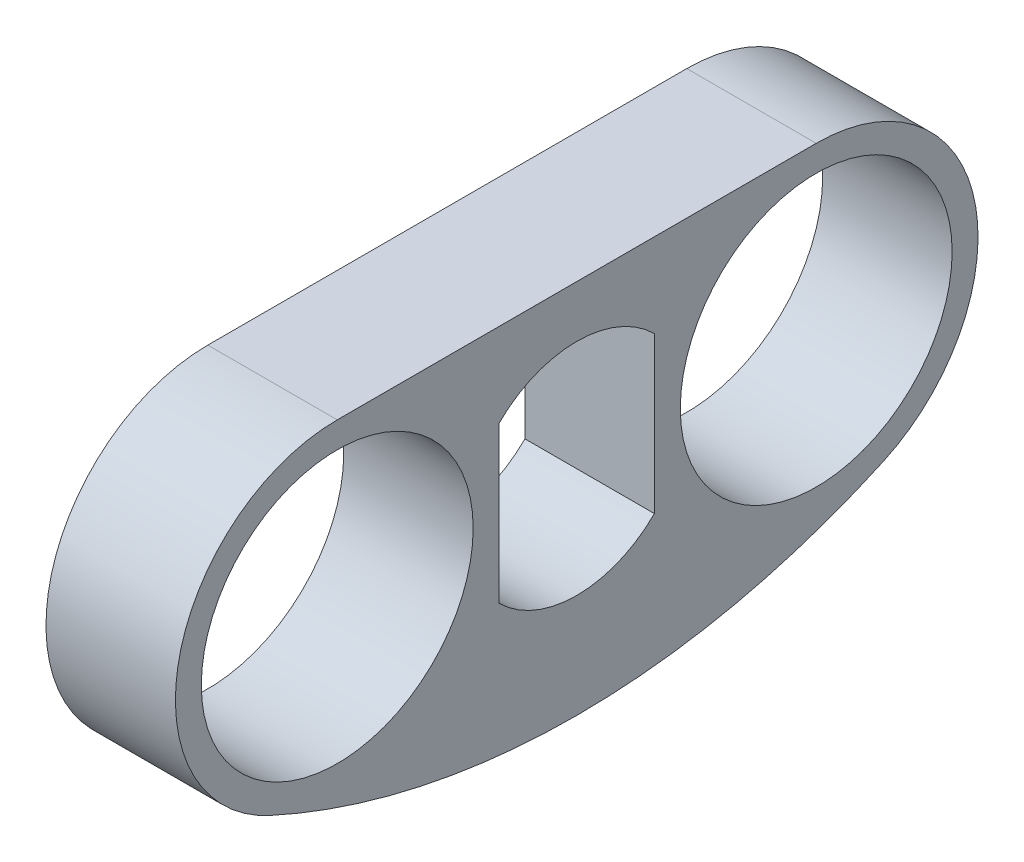
ISO-10303-21;
HEADER;
FILE_DESCRIPTION(('STEP AP214'),'2;1');
FILE_NAME('part.step','',(''),(''),'','','');
FILE_SCHEMA(('AUTOMOTIVE_DESIGN { 1 0 10303 214 1 1 1 1 }'));
ENDSEC;
DATA;
#1=APPLICATION_CONTEXT('core data for automotive mechanical design processes');
#2=APPLICATION_PROTOCOL_DEFINITION('international standard','automotive_design',2000,#1);
#3=PRODUCT_CONTEXT('',#1,'mechanical');
#4=PRODUCT('Part','Part','',(#3));
#5=PRODUCT_RELATED_PRODUCT_CATEGORY('part','',(#4));
#6=PRODUCT_DEFINITION_FORMATION('','',#4);
#7=PRODUCT_DEFINITION_CONTEXT('part definition',#1,'design');
#8=PRODUCT_DEFINITION('design','',#6,#7);
#9=PRODUCT_DEFINITION_SHAPE('','',#8);
#10=(LENGTH_UNIT() NAMED_UNIT(*) SI_UNIT(.MILLI.,.METRE.));
#11=(NAMED_UNIT(*) PLANE_ANGLE_UNIT() SI_UNIT($,.RADIAN.));
#12=(NAMED_UNIT(*) SI_UNIT($,.STERADIAN.) SOLID_ANGLE_UNIT());
#13=UNCERTAINTY_MEASURE_WITH_UNIT(LENGTH_MEASURE(1.E-05),#10,'distance_accuracy_value','');
#14=(GEOMETRIC_REPRESENTATION_CONTEXT(3) GLOBAL_UNCERTAINTY_ASSIGNED_CONTEXT((#13)) GLOBAL_UNIT_ASSIGNED_CONTEXT((#10,
#11,#12)) REPRESENTATION_CONTEXT('',''));
#15=CARTESIAN_POINT('',(0.,0.,0.));
#16=DIRECTION('',(0.,0.,1.));
#17=DIRECTION('',(1.,0.,0.));
#18=AXIS2_PLACEMENT_3D('',#15,#16,#17);
#19=CARTESIAN_POINT('',(10.,0.,18.5));
#20=DIRECTION('',(1.,0.,0.));
#21=DIRECTION('',(0.,0.,-1.));
#22=AXIS2_PLACEMENT_3D('',#19,#20,#21);
#23=PLANE('',#22);
#24=CARTESIAN_POINT('',(10.,0.,-18.5));
#25=DIRECTION('',(1.,0.,0.));
#26=DIRECTION('',(0.,0.,-1.));
#27=AXIS2_PLACEMENT_3D('',#24,#25,#26);
#28=CIRCLE('',#27,10.5);
#29=CARTESIAN_POINT('',(10.,0.,-29.));
#30=VERTEX_POINT('',#29);
#31=EDGE_CURVE('E146',#30,#30,#28,.T.);
#32=ORIENTED_EDGE('',*,*,#31,.F.);
#33=EDGE_LOOP('',(#32));
#34=FACE_BOUND('',#33,.T.);
#35=CARTESIAN_POINT('',(10.,0.,18.5));
#36=DIRECTION('',(1.,0.,0.));
#37=DIRECTION('',(0.,0.,-1.));
#38=AXIS2_PLACEMENT_3D('',#35,#36,#37);
#39=CIRCLE('',#38,12.5);
#40=CARTESIAN_POINT('',(10.,12.5,18.5));
#41=VERTEX_POINT('',#40);
#42=CARTESIAN_POINT('',(10.,-11.3685990701393,23.6966292134832));
#43=VERTEX_POINT('',#42);
#44=EDGE_CURVE('E162',#41,#43,#39,.T.);
#45=ORIENTED_EDGE('',*,*,#44,.T.);
#46=CARTESIAN_POINT('',(10.,40.4722126896961,0.));
#47=DIRECTION('',(1.,0.,0.));
#48=DIRECTION('',(0.,0.,-1.));
#49=AXIS2_PLACEMENT_3D('',#46,#47,#48);
#50=CIRCLE('',#49,57.);
#51=CARTESIAN_POINT('',(10.,-11.3685990701394,-23.6966292134831));
#52=VERTEX_POINT('',#51);
#53=EDGE_CURVE('E166',#43,#52,#50,.T.);
#54=ORIENTED_EDGE('',*,*,#53,.T.);
#55=CARTESIAN_POINT('',(10.,0.,-18.5));
#56=DIRECTION('',(1.,0.,0.));
#57=DIRECTION('',(0.,0.,-1.));
#58=AXIS2_PLACEMENT_3D('',#55,#56,#57);
#59=CIRCLE('',#58,12.5);
#60=CARTESIAN_POINT('',(10.,12.5,-18.5));
#61=VERTEX_POINT('',#60);
#62=EDGE_CURVE('E170',#52,#61,#59,.T.);
#63=ORIENTED_EDGE('',*,*,#62,.T.);
#64=DIRECTION('',(0.,0.,1.));
#65=VECTOR('',#64,1.);
#66=CARTESIAN_POINT('',(10.,12.5,18.5));
#67=LINE('',#66,#65);
#68=EDGE_CURVE('E173',#61,#41,#67,.T.);
#69=ORIENTED_EDGE('',*,*,#68,.T.);
#70=EDGE_LOOP('',(#45,#54,#63,#69));
#71=FACE_BOUND('',#70,.T.);
#72=DIRECTION('',(0.,-1.,0.));
#73=VECTOR('',#72,1.);
#74=CARTESIAN_POINT('',(10.,-6.02079728939615,6.));
#75=LINE('',#74,#73);
#76=CARTESIAN_POINT('',(10.,6.02079728939615,6.));
#77=VERTEX_POINT('',#76);
#78=CARTESIAN_POINT('',(10.,-6.02079728939615,6.));
#79=VERTEX_POINT('',#78);
#80=EDGE_CURVE('E120',#77,#79,#75,.T.);
#81=ORIENTED_EDGE('',*,*,#80,.F.);
#82=CARTESIAN_POINT('',(10.,0.,0.));
#83=DIRECTION('',(1.,0.,0.));
#84=DIRECTION('',(0.,0.,-1.));
#85=AXIS2_PLACEMENT_3D('',#82,#83,#84);
#86=CIRCLE('',#85,8.5);
#87=CARTESIAN_POINT('',(10.,6.02079728939615,-6.));
#88=VERTEX_POINT('',#87);
#89=EDGE_CURVE('E111',#88,#77,#86,.T.);
#90=ORIENTED_EDGE('',*,*,#89,.F.);
#91=DIRECTION('',(0.,1.,0.));
#92=VECTOR('',#91,1.);
#93=CARTESIAN_POINT('',(10.,-6.02079728939615,-6.));
#94=LINE('',#93,#92);
#95=CARTESIAN_POINT('',(10.,-6.02079728939615,-6.));
#96=VERTEX_POINT('',#95);
#97=EDGE_CURVE('E138',#96,#88,#94,.T.);
#98=ORIENTED_EDGE('',*,*,#97,.F.);
#99=CARTESIAN_POINT('',(10.,0.,0.));
#100=DIRECTION('',(1.,0.,0.));
#101=DIRECTION('',(0.,0.,-1.));
#102=AXIS2_PLACEMENT_3D('',#99,#100,#101);
#103=CIRCLE('',#102,8.5);
#104=EDGE_CURVE('E134',#79,#96,#103,.T.);
#105=ORIENTED_EDGE('',*,*,#104,.F.);
#106=EDGE_LOOP('',(#81,#90,#98,#105));
#107=FACE_BOUND('',#106,.T.);
#108=CARTESIAN_POINT('',(10.,0.,18.5));
#109=DIRECTION('',(1.,0.,0.));
#110=DIRECTION('',(0.,0.,1.));
#111=AXIS2_PLACEMENT_3D('',#108,#109,#110);
#112=CIRCLE('',#111,10.5);
#113=CARTESIAN_POINT('',(10.,0.,29.));
#114=VERTEX_POINT('',#113);
#115=EDGE_CURVE('E263',#114,#114,#112,.T.);
#116=ORIENTED_EDGE('',*,*,#115,.F.);
#117=EDGE_LOOP('',(#116));
#118=FACE_BOUND('',#117,.T.);
#119=ADVANCED_FACE('F45',(#34,#71,#107,#118),#23,.T.);
#120=CARTESIAN_POINT('',(0.,0.,18.5));
#121=DIRECTION('',(1.,0.,0.));
#122=DIRECTION('',(0.,0.,-1.));
#123=AXIS2_PLACEMENT_3D('',#120,#121,#122);
#124=PLANE('',#123);
#125=CARTESIAN_POINT('',(0.,0.,18.5));
#126=DIRECTION('',(1.,0.,0.));
#127=DIRECTION('',(0.,0.,-1.));
#128=AXIS2_PLACEMENT_3D('',#125,#126,#127);
#129=CIRCLE('',#128,12.5);
#130=CARTESIAN_POINT('',(0.,12.5,18.5));
#131=VERTEX_POINT('',#130);
#132=CARTESIAN_POINT('',(0.,-11.3685990701393,23.6966292134832));
#133=VERTEX_POINT('',#132);
#134=EDGE_CURVE('E129',#131,#133,#129,.T.);
#135=ORIENTED_EDGE('',*,*,#134,.F.);
#136=DIRECTION('',(0.,0.,1.));
#137=VECTOR('',#136,1.);
#138=CARTESIAN_POINT('',(0.,12.5,18.5));
#139=LINE('',#138,#137);
#140=CARTESIAN_POINT('',(0.,12.5,-18.5));
#141=VERTEX_POINT('',#140);
#142=EDGE_CURVE('E167',#141,#131,#139,.T.);
#143=ORIENTED_EDGE('',*,*,#142,.F.);
#144=CARTESIAN_POINT('',(0.,0.,-18.5));
#145=DIRECTION('',(1.,0.,0.));
#146=DIRECTION('',(0.,0.,-1.));
#147=AXIS2_PLACEMENT_3D('',#144,#145,#146);
#148=CIRCLE('',#147,12.5);
#149=CARTESIAN_POINT('',(0.,-11.3685990701394,-23.6966292134831));
#150=VERTEX_POINT('',#149);
#151=EDGE_CURVE('E183',#150,#141,#148,.T.);
#152=ORIENTED_EDGE('',*,*,#151,.F.);
#153=CARTESIAN_POINT('',(0.,40.4722126896961,0.));
#154=DIRECTION('',(1.,0.,0.));
#155=DIRECTION('',(0.,0.,-1.));
#156=AXIS2_PLACEMENT_3D('',#153,#154,#155);
#157=CIRCLE('',#156,57.);
#158=EDGE_CURVE('E180',#133,#150,#157,.T.);
#159=ORIENTED_EDGE('',*,*,#158,.F.);
#160=EDGE_LOOP('',(#135,#143,#152,#159));
#161=FACE_BOUND('',#160,.T.);
#162=CARTESIAN_POINT('',(0.,0.,0.));
#163=DIRECTION('',(1.,0.,0.));
#164=DIRECTION('',(0.,0.,-1.));
#165=AXIS2_PLACEMENT_3D('',#162,#163,#164);
#166=CIRCLE('',#165,8.5);
#167=CARTESIAN_POINT('',(0.,6.02079728939615,-6.));
#168=VERTEX_POINT('',#167);
#169=CARTESIAN_POINT('',(0.,6.02079728939615,6.));
#170=VERTEX_POINT('',#169);
#171=EDGE_CURVE('E69',#168,#170,#166,.T.);
#172=ORIENTED_EDGE('',*,*,#171,.T.);
#173=DIRECTION('',(0.,-1.,0.));
#174=VECTOR('',#173,1.);
#175=CARTESIAN_POINT('',(0.,-6.02079728939615,6.));
#176=LINE('',#175,#174);
#177=CARTESIAN_POINT('',(0.,-6.02079728939615,6.));
#178=VERTEX_POINT('',#177);
#179=EDGE_CURVE('E127',#170,#178,#176,.T.);
#180=ORIENTED_EDGE('',*,*,#179,.T.);
#181=CARTESIAN_POINT('',(0.,0.,0.));
#182=DIRECTION('',(1.,0.,0.));
#183=DIRECTION('',(0.,0.,-1.));
#184=AXIS2_PLACEMENT_3D('',#181,#182,#183);
#185=CIRCLE('',#184,8.5);
#186=CARTESIAN_POINT('',(0.,-6.02079728939615,-6.));
#187=VERTEX_POINT('',#186);
#188=EDGE_CURVE('E149',#178,#187,#185,.T.);
#189=ORIENTED_EDGE('',*,*,#188,.T.);
#190=DIRECTION('',(0.,1.,0.));
#191=VECTOR('',#190,1.);
#192=CARTESIAN_POINT('',(0.,-6.02079728939615,-6.));
#193=LINE('',#192,#191);
#194=EDGE_CURVE('E121',#187,#168,#193,.T.);
#195=ORIENTED_EDGE('',*,*,#194,.T.);
#196=EDGE_LOOP('',(#172,#180,#189,#195));
#197=FACE_BOUND('',#196,.T.);
#198=CARTESIAN_POINT('',(0.,0.,-18.5));
#199=DIRECTION('',(1.,0.,0.));
#200=DIRECTION('',(0.,0.,-1.));
#201=AXIS2_PLACEMENT_3D('',#198,#199,#200);
#202=CIRCLE('',#201,10.5);
#203=CARTESIAN_POINT('',(0.,0.,-29.));
#204=VERTEX_POINT('',#203);
#205=EDGE_CURVE('E271',#204,#204,#202,.T.);
#206=ORIENTED_EDGE('',*,*,#205,.T.);
#207=EDGE_LOOP('',(#206));
#208=FACE_BOUND('',#207,.T.);
#209=CARTESIAN_POINT('',(0.,0.,18.5));
#210=DIRECTION('',(1.,0.,0.));
#211=DIRECTION('',(0.,0.,1.));
#212=AXIS2_PLACEMENT_3D('',#209,#210,#211);
#213=CIRCLE('',#212,10.5);
#214=CARTESIAN_POINT('',(0.,0.,29.));
#215=VERTEX_POINT('',#214);
#216=EDGE_CURVE('E266',#215,#215,#213,.T.);
#217=ORIENTED_EDGE('',*,*,#216,.T.);
#218=EDGE_LOOP('',(#217));
#219=FACE_BOUND('',#218,.T.);
#220=ADVANCED_FACE('F206',(#161,#197,#208,#219),#124,.F.);
#221=CARTESIAN_POINT('',(10.,0.,18.5));
#222=DIRECTION('',(-1.,0.,0.));
#223=DIRECTION('',(0.,0.,1.));
#224=AXIS2_PLACEMENT_3D('',#221,#222,#223);
#225=CYLINDRICAL_SURFACE('',#224,12.5);
#226=ORIENTED_EDGE('',*,*,#134,.T.);
#227=DIRECTION('',(-1.,0.,0.));
#228=VECTOR('',#227,1.);
#229=CARTESIAN_POINT('',(10.,-11.3685990701393,23.6966292134832));
#230=LINE('',#229,#228);
#231=EDGE_CURVE('E11',#43,#133,#230,.T.);
#232=ORIENTED_EDGE('',*,*,#231,.F.);
#233=ORIENTED_EDGE('',*,*,#44,.F.);
#234=DIRECTION('',(-1.,0.,0.));
#235=VECTOR('',#234,1.);
#236=CARTESIAN_POINT('',(10.,12.5,18.5));
#237=LINE('',#236,#235);
#238=EDGE_CURVE('E176',#41,#131,#237,.T.);
#239=ORIENTED_EDGE('',*,*,#238,.T.);
#240=EDGE_LOOP('',(#226,#232,#233,#239));
#241=FACE_BOUND('',#240,.T.);
#242=ADVANCED_FACE('F47',(#241),#225,.T.);
#243=CARTESIAN_POINT('',(10.,40.4722126896961,0.));
#244=DIRECTION('',(-1.,0.,0.));
#245=DIRECTION('',(0.,0.,1.));
#246=AXIS2_PLACEMENT_3D('',#243,#244,#245);
#247=CYLINDRICAL_SURFACE('',#246,57.);
#248=ORIENTED_EDGE('',*,*,#158,.T.);
#249=DIRECTION('',(-1.,0.,0.));
#250=VECTOR('',#249,1.);
#251=CARTESIAN_POINT('',(10.,-11.3685990701394,-23.6966292134831));
#252=LINE('',#251,#250);
#253=EDGE_CURVE('E54',#52,#150,#252,.T.);
#254=ORIENTED_EDGE('',*,*,#253,.F.);
#255=ORIENTED_EDGE('',*,*,#53,.F.);
#256=ORIENTED_EDGE('',*,*,#231,.T.);
#257=EDGE_LOOP('',(#248,#254,#255,#256));
#258=FACE_BOUND('',#257,.T.);
#259=ADVANCED_FACE('F216',(#258),#247,.T.);
#260=CARTESIAN_POINT('',(10.,0.,-18.5));
#261=DIRECTION('',(-1.,0.,0.));
#262=DIRECTION('',(0.,0.,1.));
#263=AXIS2_PLACEMENT_3D('',#260,#261,#262);
#264=CYLINDRICAL_SURFACE('',#263,12.5);
#265=ORIENTED_EDGE('',*,*,#151,.T.);
#266=DIRECTION('',(-1.,0.,0.));
#267=VECTOR('',#266,1.);
#268=CARTESIAN_POINT('',(10.,12.5,-18.5));
#269=LINE('',#268,#267);
#270=EDGE_CURVE('E191',#61,#141,#269,.T.);
#271=ORIENTED_EDGE('',*,*,#270,.F.);
#272=ORIENTED_EDGE('',*,*,#62,.F.);
#273=ORIENTED_EDGE('',*,*,#253,.T.);
#274=EDGE_LOOP('',(#265,#271,#272,#273));
#275=FACE_BOUND('',#274,.T.);
#276=ADVANCED_FACE('F200',(#275),#264,.T.);
#277=CARTESIAN_POINT('',(10.,12.5,18.5));
#278=DIRECTION('',(0.,-1.,0.));
#279=DIRECTION('',(0.,0.,-1.));
#280=AXIS2_PLACEMENT_3D('',#277,#278,#279);
#281=PLANE('',#280);
#282=ORIENTED_EDGE('',*,*,#142,.T.);
#283=ORIENTED_EDGE('',*,*,#238,.F.);
#284=ORIENTED_EDGE('',*,*,#68,.F.);
#285=ORIENTED_EDGE('',*,*,#270,.T.);
#286=EDGE_LOOP('',(#282,#283,#284,#285));
#287=FACE_BOUND('',#286,.T.);
#288=ADVANCED_FACE('F210',(#287),#281,.F.);
#289=CARTESIAN_POINT('',(10.,0.,0.));
#290=DIRECTION('',(-1.,0.,0.));
#291=DIRECTION('',(0.,0.,1.));
#292=AXIS2_PLACEMENT_3D('',#289,#290,#291);
#293=CYLINDRICAL_SURFACE('',#292,8.5);
#294=ORIENTED_EDGE('',*,*,#171,.F.);
#295=DIRECTION('',(-1.,0.,0.));
#296=VECTOR('',#295,1.);
#297=CARTESIAN_POINT('',(10.,6.02079728939615,-6.));
#298=LINE('',#297,#296);
#299=EDGE_CURVE('E115',#88,#168,#298,.T.);
#300=ORIENTED_EDGE('',*,*,#299,.F.);
#301=ORIENTED_EDGE('',*,*,#89,.T.);
#302=DIRECTION('',(-1.,0.,0.));
#303=VECTOR('',#302,1.);
#304=CARTESIAN_POINT('',(10.,6.02079728939615,6.));
#305=LINE('',#304,#303);
#306=EDGE_CURVE('E114',#77,#170,#305,.T.);
#307=ORIENTED_EDGE('',*,*,#306,.T.);
#308=EDGE_LOOP('',(#294,#300,#301,#307));
#309=FACE_BOUND('',#308,.T.);
#310=ADVANCED_FACE('F113',(#309),#293,.F.);
#311=CARTESIAN_POINT('',(10.,-6.02079728939615,6.));
#312=DIRECTION('',(0.,0.,-1.));
#313=DIRECTION('',(-1.,0.,0.));
#314=AXIS2_PLACEMENT_3D('',#311,#312,#313);
#315=PLANE('',#314);
#316=ORIENTED_EDGE('',*,*,#179,.F.);
#317=ORIENTED_EDGE('',*,*,#306,.F.);
#318=ORIENTED_EDGE('',*,*,#80,.T.);
#319=DIRECTION('',(-1.,0.,0.));
#320=VECTOR('',#319,1.);
#321=CARTESIAN_POINT('',(10.,-6.02079728939615,6.));
#322=LINE('',#321,#320);
#323=EDGE_CURVE('E130',#79,#178,#322,.T.);
#324=ORIENTED_EDGE('',*,*,#323,.T.);
#325=EDGE_LOOP('',(#316,#317,#318,#324));
#326=FACE_BOUND('',#325,.T.);
#327=ADVANCED_FACE('F124',(#326),#315,.T.);
#328=CARTESIAN_POINT('',(10.,0.,0.));
#329=DIRECTION('',(-1.,0.,0.));
#330=DIRECTION('',(0.,0.,1.));
#331=AXIS2_PLACEMENT_3D('',#328,#329,#330);
#332=CYLINDRICAL_SURFACE('',#331,8.5);
#333=ORIENTED_EDGE('',*,*,#188,.F.);
#334=ORIENTED_EDGE('',*,*,#323,.F.);
#335=ORIENTED_EDGE('',*,*,#104,.T.);
#336=DIRECTION('',(-1.,0.,0.));
#337=VECTOR('',#336,1.);
#338=CARTESIAN_POINT('',(10.,-6.02079728939615,-6.));
#339=LINE('',#338,#337);
#340=EDGE_CURVE('E61',#96,#187,#339,.T.);
#341=ORIENTED_EDGE('',*,*,#340,.T.);
#342=EDGE_LOOP('',(#333,#334,#335,#341));
#343=FACE_BOUND('',#342,.T.);
#344=ADVANCED_FACE('F241',(#343),#332,.F.);
#345=CARTESIAN_POINT('',(10.,-6.02079728939615,-6.));
#346=DIRECTION('',(0.,0.,1.));
#347=DIRECTION('',(1.,0.,0.));
#348=AXIS2_PLACEMENT_3D('',#345,#346,#347);
#349=PLANE('',#348);
#350=ORIENTED_EDGE('',*,*,#194,.F.);
#351=ORIENTED_EDGE('',*,*,#340,.F.);
#352=ORIENTED_EDGE('',*,*,#97,.T.);
#353=ORIENTED_EDGE('',*,*,#299,.T.);
#354=EDGE_LOOP('',(#350,#351,#352,#353));
#355=FACE_BOUND('',#354,.T.);
#356=ADVANCED_FACE('F245',(#355),#349,.T.);
#357=CARTESIAN_POINT('',(10.,0.,-18.5));
#358=DIRECTION('',(-1.,0.,0.));
#359=DIRECTION('',(0.,0.,1.));
#360=AXIS2_PLACEMENT_3D('',#357,#358,#359);
#361=CYLINDRICAL_SURFACE('',#360,10.5);
#362=ORIENTED_EDGE('',*,*,#31,.T.);
#363=EDGE_LOOP('',(#362));
#364=FACE_BOUND('',#363,.T.);
#365=ORIENTED_EDGE('',*,*,#205,.F.);
#366=EDGE_LOOP('',(#365));
#367=FACE_BOUND('',#366,.T.);
#368=ADVANCED_FACE('F251',(#364,#367),#361,.F.);
#369=CARTESIAN_POINT('',(10.,0.,18.5));
#370=DIRECTION('',(-1.,0.,0.));
#371=DIRECTION('',(0.,0.,1.));
#372=AXIS2_PLACEMENT_3D('',#369,#370,#371);
#373=CYLINDRICAL_SURFACE('',#372,10.5);
#374=ORIENTED_EDGE('',*,*,#115,.T.);
#375=EDGE_LOOP('',(#374));
#376=FACE_BOUND('',#375,.T.);
#377=ORIENTED_EDGE('',*,*,#216,.F.);
#378=EDGE_LOOP('',(#377));
#379=FACE_BOUND('',#378,.T.);
#380=ADVANCED_FACE('F254',(#376,#379),#373,.F.);
#381=CLOSED_SHELL('',(#119,#220,#242,#259,#276,#288,#310,#327,#344,#356,#368,#380));
#382=MANIFOLD_SOLID_BREP('B2',#381);
#383=ADVANCED_BREP_SHAPE_REPRESENTATION('',(#18,#382),#14);
#384=SHAPE_DEFINITION_REPRESENTATION(#9,#383);
ENDSEC;
END-ISO-10303-21;
